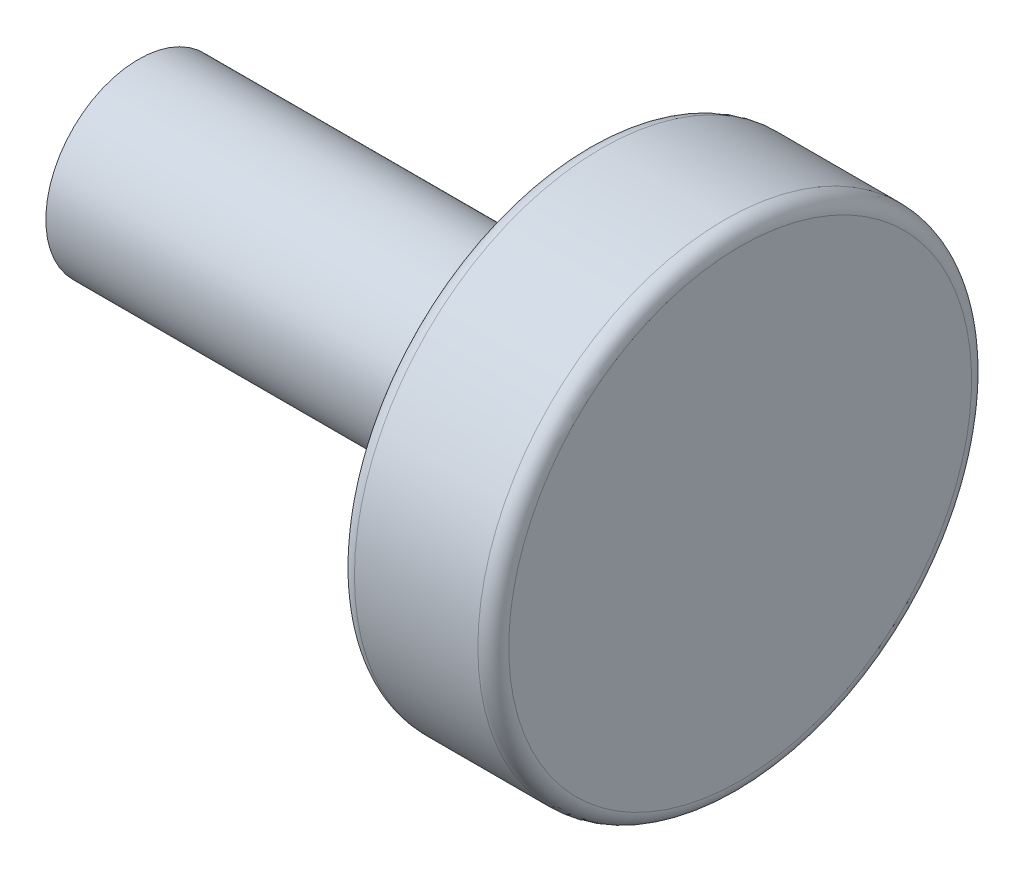
ISO-10303-21;
HEADER;
FILE_DESCRIPTION(('STEP AP214'),'2;1');
FILE_NAME('part.step','',(''),(''),'','','');
FILE_SCHEMA(('AUTOMOTIVE_DESIGN { 1 0 10303 214 1 1 1 1 }'));
ENDSEC;
DATA;
#1=APPLICATION_CONTEXT('core data for automotive mechanical design processes');
#2=APPLICATION_PROTOCOL_DEFINITION('international standard','automotive_design',2000,#1);
#3=PRODUCT_CONTEXT('',#1,'mechanical');
#4=PRODUCT('Part','Part','',(#3));
#5=PRODUCT_RELATED_PRODUCT_CATEGORY('part','',(#4));
#6=PRODUCT_DEFINITION_FORMATION('','',#4);
#7=PRODUCT_DEFINITION_CONTEXT('part definition',#1,'design');
#8=PRODUCT_DEFINITION('design','',#6,#7);
#9=PRODUCT_DEFINITION_SHAPE('','',#8);
#10=(LENGTH_UNIT() NAMED_UNIT(*) SI_UNIT(.MILLI.,.METRE.));
#11=(NAMED_UNIT(*) PLANE_ANGLE_UNIT() SI_UNIT($,.RADIAN.));
#12=(NAMED_UNIT(*) SI_UNIT($,.STERADIAN.) SOLID_ANGLE_UNIT());
#13=UNCERTAINTY_MEASURE_WITH_UNIT(LENGTH_MEASURE(1.E-05),#10,'distance_accuracy_value','');
#14=(GEOMETRIC_REPRESENTATION_CONTEXT(3) GLOBAL_UNCERTAINTY_ASSIGNED_CONTEXT((#13)) GLOBAL_UNIT_ASSIGNED_CONTEXT((#10,
#11,#12)) REPRESENTATION_CONTEXT('',''));
#15=CARTESIAN_POINT('',(0.,0.,0.));
#16=DIRECTION('',(0.,0.,1.));
#17=DIRECTION('',(1.,0.,0.));
#18=AXIS2_PLACEMENT_3D('',#15,#16,#17);
#19=CARTESIAN_POINT('',(570.894917120642,101.815701745268,-237.556360518351));
#20=DIRECTION('',(1.,0.,0.));
#21=DIRECTION('',(0.,0.,-1.));
#22=AXIS2_PLACEMENT_3D('',#19,#20,#21);
#23=PLANE('',#22);
#24=CARTESIAN_POINT('',(570.894917120642,100.315701745268,-237.556360518351));
#25=DIRECTION('',(1.,0.,0.));
#26=DIRECTION('',(0.,0.,-1.));
#27=AXIS2_PLACEMENT_3D('',#24,#25,#26);
#28=CIRCLE('',#27,2.99999999999996);
#29=CARTESIAN_POINT('',(570.894917120642,100.315701745268,-240.556360518351));
#30=VERTEX_POINT('',#29);
#31=EDGE_CURVE('E130',#30,#30,#28,.T.);
#32=ORIENTED_EDGE('',*,*,#31,.F.);
#33=EDGE_LOOP('',(#32));
#34=FACE_BOUND('',#33,.T.);
#35=ADVANCED_FACE('F17',(#34),#23,.F.);
#36=CARTESIAN_POINT('',(578.144917120642,100.315701745268,-237.556360518351));
#37=DIRECTION('',(1.,0.,0.));
#38=DIRECTION('',(0.,0.,-1.));
#39=AXIS2_PLACEMENT_3D('',#36,#37,#38);
#40=CYLINDRICAL_SURFACE('',#39,2.99999999999996);
#41=ORIENTED_EDGE('',*,*,#31,.T.);
#42=EDGE_LOOP('',(#41));
#43=FACE_BOUND('',#42,.T.);
#44=CARTESIAN_POINT('',(585.394917120642,100.315701745268,-237.556360518351));
#45=DIRECTION('',(1.,0.,0.));
#46=DIRECTION('',(0.,0.,-1.));
#47=AXIS2_PLACEMENT_3D('',#44,#45,#46);
#48=CIRCLE('',#47,2.99999999999996);
#49=CARTESIAN_POINT('',(585.394917120642,100.315701745268,-240.556360518351));
#50=VERTEX_POINT('',#49);
#51=EDGE_CURVE('E50',#50,#50,#48,.F.);
#52=ORIENTED_EDGE('',*,*,#51,.T.);
#53=EDGE_LOOP('',(#52));
#54=FACE_BOUND('',#53,.T.);
#55=ADVANCED_FACE('F144',(#43,#54),#40,.T.);
#56=CARTESIAN_POINT('',(585.394917120642,104.815701745268,-237.556360518351));
#57=DIRECTION('',(1.,0.,0.));
#58=DIRECTION('',(0.,0.,-1.));
#59=AXIS2_PLACEMENT_3D('',#56,#57,#58);
#60=PLANE('',#59);
#61=CARTESIAN_POINT('',(585.394917120642,100.315701745268,-237.556360518351));
#62=DIRECTION('',(1.,0.,0.));
#63=DIRECTION('',(0.,1.,0.));
#64=AXIS2_PLACEMENT_3D('',#61,#62,#63);
#65=CIRCLE('',#64,7.49999999999999);
#66=CARTESIAN_POINT('',(585.394917120642,107.815701745268,-237.556360518351));
#67=VERTEX_POINT('',#66);
#68=CARTESIAN_POINT('',(585.394917120642,92.8157017452682,-237.556360518351));
#69=VERTEX_POINT('',#68);
#70=EDGE_CURVE('E48',#67,#69,#65,.T.);
#71=ORIENTED_EDGE('',*,*,#70,.F.);
#72=CARTESIAN_POINT('',(585.394917120642,100.315701745268,-237.556360518351));
#73=DIRECTION('',(1.,0.,0.));
#74=DIRECTION('',(0.,-1.,0.));
#75=AXIS2_PLACEMENT_3D('',#72,#73,#74);
#76=CIRCLE('',#75,7.4999999999997);
#77=EDGE_CURVE('E42',#69,#67,#76,.T.);
#78=ORIENTED_EDGE('',*,*,#77,.F.);
#79=EDGE_LOOP('',(#71,#78));
#80=FACE_BOUND('',#79,.T.);
#81=ORIENTED_EDGE('',*,*,#51,.F.);
#82=EDGE_LOOP('',(#81));
#83=FACE_BOUND('',#82,.T.);
#84=ADVANCED_FACE('F46',(#80,#83),#60,.F.);
#85=CARTESIAN_POINT('',(585.894917120642,100.315701745268,-237.556360518351));
#86=DIRECTION('',(1.,0.,0.));
#87=DIRECTION('',(0.,1.,0.));
#88=AXIS2_PLACEMENT_3D('',#85,#86,#87);
#89=TOROIDAL_SURFACE('',#88,7.49999999999999,0.5);
#90=ORIENTED_EDGE('',*,*,#77,.T.);
#91=ORIENTED_EDGE('',*,*,#70,.T.);
#92=EDGE_LOOP('',(#90,#91));
#93=FACE_BOUND('',#92,.T.);
#94=CARTESIAN_POINT('',(585.894917120642,100.315701745268,-237.556360518351));
#95=DIRECTION('',(1.,0.,0.));
#96=DIRECTION('',(0.,0.,-1.));
#97=AXIS2_PLACEMENT_3D('',#94,#95,#96);
#98=CIRCLE('',#97,8.);
#99=CARTESIAN_POINT('',(585.894917120642,100.315701745268,-245.556360518351));
#100=VERTEX_POINT('',#99);
#101=EDGE_CURVE('E56',#100,#100,#98,.T.);
#102=ORIENTED_EDGE('',*,*,#101,.F.);
#103=EDGE_LOOP('',(#102));
#104=FACE_BOUND('',#103,.T.);
#105=ADVANCED_FACE('F54',(#93,#104),#89,.T.);
#106=CARTESIAN_POINT('',(586.894917120642,100.315701745268,-237.556360518351));
#107=DIRECTION('',(1.,0.,0.));
#108=DIRECTION('',(0.,0.,-1.));
#109=AXIS2_PLACEMENT_3D('',#106,#107,#108);
#110=CYLINDRICAL_SURFACE('',#109,8.);
#111=ORIENTED_EDGE('',*,*,#101,.T.);
#112=EDGE_LOOP('',(#111));
#113=FACE_BOUND('',#112,.T.);
#114=CARTESIAN_POINT('',(589.894917120642,100.315701745268,-237.556360518351));
#115=DIRECTION('',(1.,0.,0.));
#116=DIRECTION('',(0.,1.,0.));
#117=AXIS2_PLACEMENT_3D('',#114,#115,#116);
#118=CIRCLE('',#117,7.99999999999999);
#119=CARTESIAN_POINT('',(589.894917120642,108.315701745268,-237.556360518351));
#120=VERTEX_POINT('',#119);
#121=EDGE_CURVE('E89',#120,#120,#118,.T.);
#122=ORIENTED_EDGE('',*,*,#121,.F.);
#123=EDGE_LOOP('',(#122));
#124=FACE_BOUND('',#123,.T.);
#125=ADVANCED_FACE('F74',(#113,#124),#110,.T.);
#126=CARTESIAN_POINT('',(589.894917120642,100.315701745268,-237.556360518351));
#127=DIRECTION('',(1.,0.,0.));
#128=DIRECTION('',(0.,1.,0.));
#129=AXIS2_PLACEMENT_3D('',#126,#127,#128);
#130=TOROIDAL_SURFACE('',#129,7.49999999999999,0.5);
#131=ORIENTED_EDGE('',*,*,#121,.T.);
#132=EDGE_LOOP('',(#131));
#133=FACE_BOUND('',#132,.T.);
#134=CARTESIAN_POINT('',(590.394917120642,100.315701745268,-237.556360518351));
#135=DIRECTION('',(-1.,0.,0.));
#136=DIRECTION('',(0.,-1.,0.));
#137=AXIS2_PLACEMENT_3D('',#134,#135,#136);
#138=CIRCLE('',#137,7.49999999999985);
#139=CARTESIAN_POINT('',(590.394917120642,107.815701745268,-237.556360518351));
#140=VERTEX_POINT('',#139);
#141=CARTESIAN_POINT('',(590.394917120642,92.8157017452682,-237.556360518351));
#142=VERTEX_POINT('',#141);
#143=EDGE_CURVE('E11',#140,#142,#138,.F.);
#144=ORIENTED_EDGE('',*,*,#143,.F.);
#145=CARTESIAN_POINT('',(590.394917120642,100.315701745268,-237.556360518351));
#146=DIRECTION('',(-1.,0.,0.));
#147=DIRECTION('',(0.,1.,0.));
#148=AXIS2_PLACEMENT_3D('',#145,#146,#147);
#149=CIRCLE('',#148,7.49999999999999);
#150=EDGE_CURVE('E28',#142,#140,#149,.F.);
#151=ORIENTED_EDGE('',*,*,#150,.F.);
#152=EDGE_LOOP('',(#144,#151));
#153=FACE_BOUND('',#152,.T.);
#154=ADVANCED_FACE('F95',(#133,#153),#130,.T.);
#155=CARTESIAN_POINT('',(590.394917120642,103.315701745268,-237.556360518351));
#156=DIRECTION('',(1.,0.,0.));
#157=DIRECTION('',(0.,0.,-1.));
#158=AXIS2_PLACEMENT_3D('',#155,#156,#157);
#159=PLANE('',#158);
#160=ORIENTED_EDGE('',*,*,#150,.T.);
#161=ORIENTED_EDGE('',*,*,#143,.T.);
#162=EDGE_LOOP('',(#160,#161));
#163=FACE_BOUND('',#162,.T.);
#164=ADVANCED_FACE('F104',(#163),#159,.T.);
#165=CLOSED_SHELL('',(#35,#55,#84,#105,#125,#154,#164));
#166=MANIFOLD_SOLID_BREP('B1',#165);
#167=ADVANCED_BREP_SHAPE_REPRESENTATION('',(#18,#166),#14);
#168=SHAPE_DEFINITION_REPRESENTATION(#9,#167);
ENDSEC;
END-ISO-10303-21;
